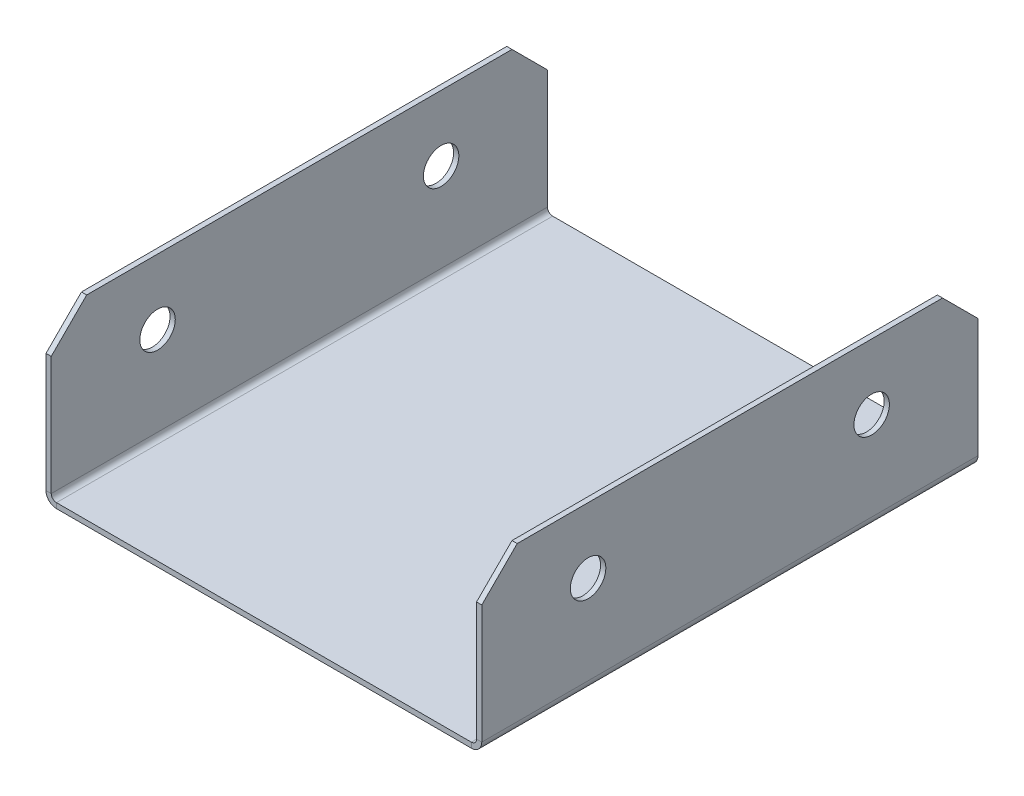
ISO-10303-21;
HEADER;
FILE_DESCRIPTION(('STEP AP214'),'2;1');
FILE_NAME('part.step','',(''),(''),'','','');
FILE_SCHEMA(('AUTOMOTIVE_DESIGN { 1 0 10303 214 1 1 1 1 }'));
ENDSEC;
DATA;
#1=APPLICATION_CONTEXT('core data for automotive mechanical design processes');
#2=APPLICATION_PROTOCOL_DEFINITION('international standard','automotive_design',2000,#1);
#3=PRODUCT_CONTEXT('',#1,'mechanical');
#4=PRODUCT('Part','Part','',(#3));
#5=PRODUCT_RELATED_PRODUCT_CATEGORY('part','',(#4));
#6=PRODUCT_DEFINITION_FORMATION('','',#4);
#7=PRODUCT_DEFINITION_CONTEXT('part definition',#1,'design');
#8=PRODUCT_DEFINITION('design','',#6,#7);
#9=PRODUCT_DEFINITION_SHAPE('','',#8);
#10=(LENGTH_UNIT() NAMED_UNIT(*) SI_UNIT(.MILLI.,.METRE.));
#11=(NAMED_UNIT(*) PLANE_ANGLE_UNIT() SI_UNIT($,.RADIAN.));
#12=(NAMED_UNIT(*) SI_UNIT($,.STERADIAN.) SOLID_ANGLE_UNIT());
#13=UNCERTAINTY_MEASURE_WITH_UNIT(LENGTH_MEASURE(1.E-05),#10,'distance_accuracy_value','');
#14=(GEOMETRIC_REPRESENTATION_CONTEXT(3) GLOBAL_UNCERTAINTY_ASSIGNED_CONTEXT((#13)) GLOBAL_UNIT_ASSIGNED_CONTEXT((#10,
#11,#12)) REPRESENTATION_CONTEXT('',''));
#15=CARTESIAN_POINT('',(0.,0.,0.));
#16=DIRECTION('',(0.,0.,1.));
#17=DIRECTION('',(1.,0.,0.));
#18=AXIS2_PLACEMENT_3D('',#15,#16,#17);
#19=CARTESIAN_POINT('',(-29.2634,0.,70.));
#20=DIRECTION('',(0.,0.,1.));
#21=DIRECTION('',(1.,0.,0.));
#22=AXIS2_PLACEMENT_3D('',#19,#20,#21);
#23=PLANE('',#22);
#24=DIRECTION('',(0.,-1.,0.));
#25=VECTOR('',#24,1.);
#26=CARTESIAN_POINT('',(-29.2634,0.,70.));
#27=LINE('',#26,#25);
#28=CARTESIAN_POINT('',(-29.2634,0.,70.));
#29=VERTEX_POINT('',#28);
#30=CARTESIAN_POINT('',(-29.2634,-0.7366,70.));
#31=VERTEX_POINT('',#30);
#32=EDGE_CURVE('E270',#29,#31,#27,.T.);
#33=ORIENTED_EDGE('',*,*,#32,.F.);
#34=CARTESIAN_POINT('',(-29.2634,0.736600000000004,70.));
#35=DIRECTION('',(0.,0.,-1.));
#36=DIRECTION('',(-1.,0.,0.));
#37=AXIS2_PLACEMENT_3D('',#34,#35,#36);
#38=CIRCLE('',#37,0.7366);
#39=CARTESIAN_POINT('',(-30.,0.736600000000018,70.));
#40=VERTEX_POINT('',#39);
#41=EDGE_CURVE('E186',#40,#29,#38,.F.);
#42=ORIENTED_EDGE('',*,*,#41,.F.);
#43=DIRECTION('',(1.,0.,0.));
#44=VECTOR('',#43,1.);
#45=CARTESIAN_POINT('',(-30.7366,0.736600000000032,70.));
#46=LINE('',#45,#44);
#47=CARTESIAN_POINT('',(-30.7366,0.736600000000032,70.));
#48=VERTEX_POINT('',#47);
#49=EDGE_CURVE('E267',#48,#40,#46,.T.);
#50=ORIENTED_EDGE('',*,*,#49,.F.);
#51=CARTESIAN_POINT('',(-29.2634,0.736600000000004,70.));
#52=DIRECTION('',(0.,0.,1.));
#53=DIRECTION('',(1.,0.,0.));
#54=AXIS2_PLACEMENT_3D('',#51,#52,#53);
#55=CIRCLE('',#54,1.4732);
#56=EDGE_CURVE('E196',#48,#31,#55,.T.);
#57=ORIENTED_EDGE('',*,*,#56,.T.);
#58=EDGE_LOOP('',(#33,#42,#50,#57));
#59=FACE_BOUND('',#58,.T.);
#60=ADVANCED_FACE('F37',(#59),#23,.T.);
#61=CARTESIAN_POINT('',(-30.7366,0.736600000000032,70.));
#62=DIRECTION('',(0.,0.,1.));
#63=DIRECTION('',(1.,0.,0.));
#64=AXIS2_PLACEMENT_3D('',#61,#62,#63);
#65=PLANE('',#64);
#66=DIRECTION('',(1.,0.,0.));
#67=VECTOR('',#66,1.);
#68=CARTESIAN_POINT('',(-30.,0.,70.));
#69=LINE('',#68,#67);
#70=CARTESIAN_POINT('',(29.2634,0.,70.));
#71=VERTEX_POINT('',#70);
#72=EDGE_CURVE('E184',#29,#71,#69,.T.);
#73=ORIENTED_EDGE('',*,*,#72,.F.);
#74=ORIENTED_EDGE('',*,*,#32,.T.);
#75=DIRECTION('',(1.,0.,0.));
#76=VECTOR('',#75,1.);
#77=CARTESIAN_POINT('',(-30.,-0.7366,70.));
#78=LINE('',#77,#76);
#79=CARTESIAN_POINT('',(29.2634,-0.736599999999989,70.));
#80=VERTEX_POINT('',#79);
#81=EDGE_CURVE('E199',#31,#80,#78,.T.);
#82=ORIENTED_EDGE('',*,*,#81,.T.);
#83=DIRECTION('',(0.,1.,0.));
#84=VECTOR('',#83,1.);
#85=CARTESIAN_POINT('',(29.2634,-0.736599999999989,70.));
#86=LINE('',#85,#84);
#87=EDGE_CURVE('E164',#80,#71,#86,.T.);
#88=ORIENTED_EDGE('',*,*,#87,.T.);
#89=EDGE_LOOP('',(#73,#74,#82,#88));
#90=FACE_BOUND('',#89,.T.);
#91=ADVANCED_FACE('F358',(#90),#65,.T.);
#92=CARTESIAN_POINT('',(-30.,0.736600000000018,0.));
#93=DIRECTION('',(0.,0.,-1.));
#94=DIRECTION('',(-1.,0.,0.));
#95=AXIS2_PLACEMENT_3D('',#92,#93,#94);
#96=PLANE('',#95);
#97=DIRECTION('',(-1.,0.,0.));
#98=VECTOR('',#97,1.);
#99=CARTESIAN_POINT('',(-30.,0.736600000000018,0.));
#100=LINE('',#99,#98);
#101=CARTESIAN_POINT('',(-30.,0.736600000000018,0.));
#102=VERTEX_POINT('',#101);
#103=CARTESIAN_POINT('',(-30.7366,0.736600000000032,0.));
#104=VERTEX_POINT('',#103);
#105=EDGE_CURVE('E264',#102,#104,#100,.T.);
#106=ORIENTED_EDGE('',*,*,#105,.F.);
#107=CARTESIAN_POINT('',(-29.2634,0.736600000000004,0.));
#108=DIRECTION('',(0.,0.,-1.));
#109=DIRECTION('',(-1.,0.,0.));
#110=AXIS2_PLACEMENT_3D('',#107,#108,#109);
#111=CIRCLE('',#110,0.7366);
#112=CARTESIAN_POINT('',(-29.2634,0.,0.));
#113=VERTEX_POINT('',#112);
#114=EDGE_CURVE('E214',#102,#113,#111,.F.);
#115=ORIENTED_EDGE('',*,*,#114,.T.);
#116=DIRECTION('',(0.,1.,0.));
#117=VECTOR('',#116,1.);
#118=CARTESIAN_POINT('',(-29.2634,-0.7366,0.));
#119=LINE('',#118,#117);
#120=CARTESIAN_POINT('',(-29.2634,-0.7366,0.));
#121=VERTEX_POINT('',#120);
#122=EDGE_CURVE('E163',#121,#113,#119,.T.);
#123=ORIENTED_EDGE('',*,*,#122,.F.);
#124=CARTESIAN_POINT('',(-29.2634,0.736600000000004,0.));
#125=DIRECTION('',(0.,0.,1.));
#126=DIRECTION('',(1.,0.,0.));
#127=AXIS2_PLACEMENT_3D('',#124,#125,#126);
#128=CIRCLE('',#127,1.4732);
#129=EDGE_CURVE('E221',#104,#121,#128,.T.);
#130=ORIENTED_EDGE('',*,*,#129,.F.);
#131=EDGE_LOOP('',(#106,#115,#123,#130));
#132=FACE_BOUND('',#131,.T.);
#133=ADVANCED_FACE('F320',(#132),#96,.T.);
#134=CARTESIAN_POINT('',(-29.2634,-0.7366,0.));
#135=DIRECTION('',(0.,0.,-1.));
#136=DIRECTION('',(-1.,0.,0.));
#137=AXIS2_PLACEMENT_3D('',#134,#135,#136);
#138=PLANE('',#137);
#139=DIRECTION('',(0.,1.,0.));
#140=VECTOR('',#139,1.);
#141=CARTESIAN_POINT('',(-30.7366,22.5,0.));
#142=LINE('',#141,#140);
#143=CARTESIAN_POINT('',(-30.7366,17.5,0.));
#144=VERTEX_POINT('',#143);
#145=EDGE_CURVE('E219',#144,#104,#142,.F.);
#146=ORIENTED_EDGE('',*,*,#145,.F.);
#147=DIRECTION('',(1.,0.,0.));
#148=VECTOR('',#147,1.);
#149=CARTESIAN_POINT('',(-29.2634,17.5,0.));
#150=LINE('',#149,#148);
#151=CARTESIAN_POINT('',(-30.,17.5,0.));
#152=VERTEX_POINT('',#151);
#153=EDGE_CURVE('E45',#144,#152,#150,.T.);
#154=ORIENTED_EDGE('',*,*,#153,.T.);
#155=DIRECTION('',(0.,-1.,0.));
#156=VECTOR('',#155,1.);
#157=CARTESIAN_POINT('',(-30.,22.5,0.));
#158=LINE('',#157,#156);
#159=EDGE_CURVE('E217',#152,#102,#158,.T.);
#160=ORIENTED_EDGE('',*,*,#159,.T.);
#161=ORIENTED_EDGE('',*,*,#105,.T.);
#162=EDGE_LOOP('',(#146,#154,#160,#161));
#163=FACE_BOUND('',#162,.T.);
#164=ADVANCED_FACE('F304',(#163),#138,.T.);
#165=CARTESIAN_POINT('',(30.,0.73660000000001,70.));
#166=DIRECTION('',(0.,0.,1.));
#167=DIRECTION('',(1.,0.,0.));
#168=AXIS2_PLACEMENT_3D('',#165,#166,#167);
#169=PLANE('',#168);
#170=DIRECTION('',(1.,0.,0.));
#171=VECTOR('',#170,1.);
#172=CARTESIAN_POINT('',(30.,0.73660000000001,70.));
#173=LINE('',#172,#171);
#174=CARTESIAN_POINT('',(30.,0.73660000000001,70.));
#175=VERTEX_POINT('',#174);
#176=CARTESIAN_POINT('',(30.7366,0.73660000000001,70.));
#177=VERTEX_POINT('',#176);
#178=EDGE_CURVE('E154',#175,#177,#173,.T.);
#179=ORIENTED_EDGE('',*,*,#178,.F.);
#180=CARTESIAN_POINT('',(29.2634,0.736600000000011,70.));
#181=DIRECTION('',(0.,0.,-1.));
#182=DIRECTION('',(-1.,0.,0.));
#183=AXIS2_PLACEMENT_3D('',#180,#181,#182);
#184=CIRCLE('',#183,0.7366);
#185=EDGE_CURVE('E158',#71,#175,#184,.F.);
#186=ORIENTED_EDGE('',*,*,#185,.F.);
#187=ORIENTED_EDGE('',*,*,#87,.F.);
#188=CARTESIAN_POINT('',(29.2634,0.736600000000011,70.));
#189=DIRECTION('',(0.,0.,1.));
#190=DIRECTION('',(1.,0.,0.));
#191=AXIS2_PLACEMENT_3D('',#188,#189,#190);
#192=CIRCLE('',#191,1.4732);
#193=EDGE_CURVE('E161',#80,#177,#192,.T.);
#194=ORIENTED_EDGE('',*,*,#193,.T.);
#195=EDGE_LOOP('',(#179,#186,#187,#194));
#196=FACE_BOUND('',#195,.T.);
#197=ADVANCED_FACE('F156',(#196),#169,.T.);
#198=CARTESIAN_POINT('',(29.2634,-0.736599999999989,70.));
#199=DIRECTION('',(0.,0.,1.));
#200=DIRECTION('',(1.,0.,0.));
#201=AXIS2_PLACEMENT_3D('',#198,#199,#200);
#202=PLANE('',#201);
#203=DIRECTION('',(0.,1.,0.));
#204=VECTOR('',#203,1.);
#205=CARTESIAN_POINT('',(30.7366,0.,70.));
#206=LINE('',#205,#204);
#207=CARTESIAN_POINT('',(30.7366,17.5,70.));
#208=VERTEX_POINT('',#207);
#209=EDGE_CURVE('E179',#177,#208,#206,.T.);
#210=ORIENTED_EDGE('',*,*,#209,.T.);
#211=DIRECTION('',(-1.,0.,0.));
#212=VECTOR('',#211,1.);
#213=CARTESIAN_POINT('',(29.2634,17.5,70.));
#214=LINE('',#213,#212);
#215=CARTESIAN_POINT('',(30.,17.5,70.));
#216=VERTEX_POINT('',#215);
#217=EDGE_CURVE('E60',#208,#216,#214,.T.);
#218=ORIENTED_EDGE('',*,*,#217,.T.);
#219=DIRECTION('',(0.,1.,0.));
#220=VECTOR('',#219,1.);
#221=CARTESIAN_POINT('',(30.,0.,70.));
#222=LINE('',#221,#220);
#223=EDGE_CURVE('E169',#175,#216,#222,.T.);
#224=ORIENTED_EDGE('',*,*,#223,.F.);
#225=ORIENTED_EDGE('',*,*,#178,.T.);
#226=EDGE_LOOP('',(#210,#218,#224,#225));
#227=FACE_BOUND('',#226,.T.);
#228=ADVANCED_FACE('F178',(#227),#202,.T.);
#229=CARTESIAN_POINT('',(29.2634,0.,0.));
#230=DIRECTION('',(0.,0.,-1.));
#231=DIRECTION('',(-1.,0.,0.));
#232=AXIS2_PLACEMENT_3D('',#229,#230,#231);
#233=PLANE('',#232);
#234=DIRECTION('',(0.,-1.,0.));
#235=VECTOR('',#234,1.);
#236=CARTESIAN_POINT('',(29.2634,0.,0.));
#237=LINE('',#236,#235);
#238=CARTESIAN_POINT('',(29.2634,0.,0.));
#239=VERTEX_POINT('',#238);
#240=CARTESIAN_POINT('',(29.2634,-0.736599999999989,0.));
#241=VERTEX_POINT('',#240);
#242=EDGE_CURVE('E260',#239,#241,#237,.T.);
#243=ORIENTED_EDGE('',*,*,#242,.F.);
#244=CARTESIAN_POINT('',(29.2634,0.736600000000011,0.));
#245=DIRECTION('',(0.,0.,-1.));
#246=DIRECTION('',(-1.,0.,0.));
#247=AXIS2_PLACEMENT_3D('',#244,#245,#246);
#248=CIRCLE('',#247,0.7366);
#249=CARTESIAN_POINT('',(30.,0.73660000000001,0.));
#250=VERTEX_POINT('',#249);
#251=EDGE_CURVE('E209',#239,#250,#248,.F.);
#252=ORIENTED_EDGE('',*,*,#251,.T.);
#253=DIRECTION('',(-1.,0.,0.));
#254=VECTOR('',#253,1.);
#255=CARTESIAN_POINT('',(30.7366,0.73660000000001,0.));
#256=LINE('',#255,#254);
#257=CARTESIAN_POINT('',(30.7366,0.73660000000001,0.));
#258=VERTEX_POINT('',#257);
#259=EDGE_CURVE('E258',#258,#250,#256,.T.);
#260=ORIENTED_EDGE('',*,*,#259,.F.);
#261=CARTESIAN_POINT('',(29.2634,0.736600000000011,0.));
#262=DIRECTION('',(0.,0.,1.));
#263=DIRECTION('',(1.,0.,0.));
#264=AXIS2_PLACEMENT_3D('',#261,#262,#263);
#265=CIRCLE('',#264,1.4732);
#266=EDGE_CURVE('E227',#241,#258,#265,.T.);
#267=ORIENTED_EDGE('',*,*,#266,.F.);
#268=EDGE_LOOP('',(#243,#252,#260,#267));
#269=FACE_BOUND('',#268,.T.);
#270=ADVANCED_FACE('F374',(#269),#233,.T.);
#271=CARTESIAN_POINT('',(30.7366,0.73660000000001,0.));
#272=DIRECTION('',(0.,0.,-1.));
#273=DIRECTION('',(-1.,0.,0.));
#274=AXIS2_PLACEMENT_3D('',#271,#272,#273);
#275=PLANE('',#274);
#276=DIRECTION('',(1.,0.,0.));
#277=VECTOR('',#276,1.);
#278=CARTESIAN_POINT('',(-30.,0.,0.));
#279=LINE('',#278,#277);
#280=EDGE_CURVE('E211',#113,#239,#279,.T.);
#281=ORIENTED_EDGE('',*,*,#280,.T.);
#282=ORIENTED_EDGE('',*,*,#242,.T.);
#283=DIRECTION('',(1.,0.,0.));
#284=VECTOR('',#283,1.);
#285=CARTESIAN_POINT('',(-30.,-0.7366,0.));
#286=LINE('',#285,#284);
#287=EDGE_CURVE('E224',#121,#241,#286,.T.);
#288=ORIENTED_EDGE('',*,*,#287,.F.);
#289=ORIENTED_EDGE('',*,*,#122,.T.);
#290=EDGE_LOOP('',(#281,#282,#288,#289));
#291=FACE_BOUND('',#290,.T.);
#292=ADVANCED_FACE('F377',(#291),#275,.T.);
#293=CARTESIAN_POINT('',(30.7366,0.,70.));
#294=DIRECTION('',(-1.,0.,0.));
#295=DIRECTION('',(0.,0.,1.));
#296=AXIS2_PLACEMENT_3D('',#293,#294,#295);
#297=PLANE('',#296);
#298=CARTESIAN_POINT('',(30.7366,13.2634,55.));
#299=DIRECTION('',(1.,0.,0.));
#300=DIRECTION('',(0.,0.,-1.));
#301=AXIS2_PLACEMENT_3D('',#298,#299,#300);
#302=CIRCLE('',#301,2.5);
#303=CARTESIAN_POINT('',(30.7366,13.2634,52.5));
#304=VERTEX_POINT('',#303);
#305=EDGE_CURVE('E442',#304,#304,#302,.T.);
#306=ORIENTED_EDGE('',*,*,#305,.F.);
#307=EDGE_LOOP('',(#306));
#308=FACE_BOUND('',#307,.T.);
#309=CARTESIAN_POINT('',(30.7366,13.2634,15.));
#310=DIRECTION('',(1.,0.,0.));
#311=DIRECTION('',(0.,0.,-1.));
#312=AXIS2_PLACEMENT_3D('',#309,#310,#311);
#313=CIRCLE('',#312,2.5);
#314=CARTESIAN_POINT('',(30.7366,13.2634,12.5));
#315=VERTEX_POINT('',#314);
#316=EDGE_CURVE('E451',#315,#315,#313,.T.);
#317=ORIENTED_EDGE('',*,*,#316,.F.);
#318=EDGE_LOOP('',(#317));
#319=FACE_BOUND('',#318,.T.);
#320=DIRECTION('',(0.,0.,-1.));
#321=VECTOR('',#320,1.);
#322=CARTESIAN_POINT('',(30.7366,22.5,70.));
#323=LINE('',#322,#321);
#324=CARTESIAN_POINT('',(30.7366,22.5,65.));
#325=VERTEX_POINT('',#324);
#326=CARTESIAN_POINT('',(30.7366,22.5,5.));
#327=VERTEX_POINT('',#326);
#328=EDGE_CURVE('E255',#325,#327,#323,.T.);
#329=ORIENTED_EDGE('',*,*,#328,.F.);
#330=DIRECTION('',(0.,0.707106781186547,-0.707106781186549));
#331=VECTOR('',#330,1.);
#332=CARTESIAN_POINT('',(30.7366,22.5,65.));
#333=LINE('',#332,#331);
#334=EDGE_CURVE('E294',#325,#208,#333,.F.);
#335=ORIENTED_EDGE('',*,*,#334,.T.);
#336=ORIENTED_EDGE('',*,*,#209,.F.);
#337=DIRECTION('',(0.,0.,-1.));
#338=VECTOR('',#337,1.);
#339=CARTESIAN_POINT('',(30.7366,0.73660000000001,70.));
#340=LINE('',#339,#338);
#341=EDGE_CURVE('E203',#177,#258,#340,.T.);
#342=ORIENTED_EDGE('',*,*,#341,.T.);
#343=DIRECTION('',(0.,1.,0.));
#344=VECTOR('',#343,1.);
#345=CARTESIAN_POINT('',(30.7366,0.,0.));
#346=LINE('',#345,#344);
#347=CARTESIAN_POINT('',(30.7366,17.5,0.));
#348=VERTEX_POINT('',#347);
#349=EDGE_CURVE('E204',#258,#348,#346,.T.);
#350=ORIENTED_EDGE('',*,*,#349,.T.);
#351=DIRECTION('',(0.,-0.707106781186549,-0.707106781186547));
#352=VECTOR('',#351,1.);
#353=CARTESIAN_POINT('',(30.7366,17.5,0.));
#354=LINE('',#353,#352);
#355=EDGE_CURVE('E292',#348,#327,#354,.F.);
#356=ORIENTED_EDGE('',*,*,#355,.T.);
#357=EDGE_LOOP('',(#329,#335,#336,#342,#350,#356));
#358=FACE_BOUND('',#357,.T.);
#359=ADVANCED_FACE('F381',(#308,#319,#358),#297,.F.);
#360=CARTESIAN_POINT('',(30.,22.5,70.));
#361=DIRECTION('',(0.,1.,0.));
#362=DIRECTION('',(0.,0.,1.));
#363=AXIS2_PLACEMENT_3D('',#360,#361,#362);
#364=PLANE('',#363);
#365=DIRECTION('',(0.,0.,-1.));
#366=VECTOR('',#365,1.);
#367=CARTESIAN_POINT('',(30.,22.5,70.));
#368=LINE('',#367,#366);
#369=CARTESIAN_POINT('',(30.,22.5,65.));
#370=VERTEX_POINT('',#369);
#371=CARTESIAN_POINT('',(30.,22.5,5.));
#372=VERTEX_POINT('',#371);
#373=EDGE_CURVE('E175',#370,#372,#368,.T.);
#374=ORIENTED_EDGE('',*,*,#373,.F.);
#375=DIRECTION('',(1.,0.,0.));
#376=VECTOR('',#375,1.);
#377=CARTESIAN_POINT('',(30.,22.5,65.));
#378=LINE('',#377,#376);
#379=EDGE_CURVE('E289',#370,#325,#378,.T.);
#380=ORIENTED_EDGE('',*,*,#379,.T.);
#381=ORIENTED_EDGE('',*,*,#328,.T.);
#382=DIRECTION('',(-1.,0.,0.));
#383=VECTOR('',#382,1.);
#384=CARTESIAN_POINT('',(30.,22.5,5.));
#385=LINE('',#384,#383);
#386=EDGE_CURVE('E287',#327,#372,#385,.T.);
#387=ORIENTED_EDGE('',*,*,#386,.T.);
#388=EDGE_LOOP('',(#374,#380,#381,#387));
#389=FACE_BOUND('',#388,.T.);
#390=ADVANCED_FACE('F385',(#389),#364,.T.);
#391=CARTESIAN_POINT('',(30.,0.,70.));
#392=DIRECTION('',(-1.,0.,0.));
#393=DIRECTION('',(0.,0.,1.));
#394=AXIS2_PLACEMENT_3D('',#391,#392,#393);
#395=PLANE('',#394);
#396=CARTESIAN_POINT('',(30.,13.2634,55.));
#397=DIRECTION('',(-1.,0.,0.));
#398=DIRECTION('',(0.,0.,1.));
#399=AXIS2_PLACEMENT_3D('',#396,#397,#398);
#400=CIRCLE('',#399,2.5);
#401=CARTESIAN_POINT('',(30.,13.2634,57.5));
#402=VERTEX_POINT('',#401);
#403=EDGE_CURVE('E444',#402,#402,#400,.T.);
#404=ORIENTED_EDGE('',*,*,#403,.F.);
#405=EDGE_LOOP('',(#404));
#406=FACE_BOUND('',#405,.T.);
#407=CARTESIAN_POINT('',(30.,13.2634,15.));
#408=DIRECTION('',(-1.,0.,0.));
#409=DIRECTION('',(0.,0.,1.));
#410=AXIS2_PLACEMENT_3D('',#407,#408,#409);
#411=CIRCLE('',#410,2.5);
#412=CARTESIAN_POINT('',(30.,13.2634,17.5));
#413=VERTEX_POINT('',#412);
#414=EDGE_CURVE('E207',#413,#413,#411,.T.);
#415=ORIENTED_EDGE('',*,*,#414,.F.);
#416=EDGE_LOOP('',(#415));
#417=FACE_BOUND('',#416,.T.);
#418=ORIENTED_EDGE('',*,*,#223,.T.);
#419=DIRECTION('',(0.,-0.707106781186547,0.707106781186549));
#420=VECTOR('',#419,1.);
#421=CARTESIAN_POINT('',(30.,8.75000000000003,78.75));
#422=LINE('',#421,#420);
#423=EDGE_CURVE('E298',#216,#370,#422,.F.);
#424=ORIENTED_EDGE('',*,*,#423,.T.);
#425=ORIENTED_EDGE('',*,*,#373,.T.);
#426=DIRECTION('',(0.,0.707106781186549,0.707106781186547));
#427=VECTOR('',#426,1.);
#428=CARTESIAN_POINT('',(30.,43.75,26.2499999999999));
#429=LINE('',#428,#427);
#430=CARTESIAN_POINT('',(30.,17.5,0.));
#431=VERTEX_POINT('',#430);
#432=EDGE_CURVE('E52',#372,#431,#429,.F.);
#433=ORIENTED_EDGE('',*,*,#432,.T.);
#434=DIRECTION('',(0.,1.,0.));
#435=VECTOR('',#434,1.);
#436=CARTESIAN_POINT('',(30.,0.,0.));
#437=LINE('',#436,#435);
#438=EDGE_CURVE('E171',#250,#431,#437,.T.);
#439=ORIENTED_EDGE('',*,*,#438,.F.);
#440=DIRECTION('',(0.,0.,-1.));
#441=VECTOR('',#440,1.);
#442=CARTESIAN_POINT('',(30.,0.73660000000001,70.));
#443=LINE('',#442,#441);
#444=EDGE_CURVE('E167',#175,#250,#443,.T.);
#445=ORIENTED_EDGE('',*,*,#444,.F.);
#446=EDGE_LOOP('',(#418,#424,#425,#433,#439,#445));
#447=FACE_BOUND('',#446,.T.);
#448=ADVANCED_FACE('F168',(#406,#417,#447),#395,.T.);
#449=CARTESIAN_POINT('',(29.2634,0.736600000000011,70.));
#450=DIRECTION('',(0.,0.,-1.));
#451=DIRECTION('',(-1.,0.,0.));
#452=AXIS2_PLACEMENT_3D('',#449,#450,#451);
#453=CYLINDRICAL_SURFACE('',#452,0.7366);
#454=ORIENTED_EDGE('',*,*,#251,.F.);
#455=DIRECTION('',(0.,0.,-1.));
#456=VECTOR('',#455,1.);
#457=CARTESIAN_POINT('',(29.2634,0.,70.));
#458=LINE('',#457,#456);
#459=EDGE_CURVE('E176',#71,#239,#458,.T.);
#460=ORIENTED_EDGE('',*,*,#459,.F.);
#461=ORIENTED_EDGE('',*,*,#185,.T.);
#462=ORIENTED_EDGE('',*,*,#444,.T.);
#463=EDGE_LOOP('',(#454,#460,#461,#462));
#464=FACE_BOUND('',#463,.T.);
#465=ADVANCED_FACE('F182',(#464),#453,.F.);
#466=CARTESIAN_POINT('',(-30.,0.,70.));
#467=DIRECTION('',(0.,1.,0.));
#468=DIRECTION('',(-1.,0.,0.));
#469=AXIS2_PLACEMENT_3D('',#466,#467,#468);
#470=PLANE('',#469);
#471=ORIENTED_EDGE('',*,*,#280,.F.);
#472=DIRECTION('',(0.,0.,-1.));
#473=VECTOR('',#472,1.);
#474=CARTESIAN_POINT('',(-29.2634,0.,70.));
#475=LINE('',#474,#473);
#476=EDGE_CURVE('E250',#29,#113,#475,.T.);
#477=ORIENTED_EDGE('',*,*,#476,.F.);
#478=ORIENTED_EDGE('',*,*,#72,.T.);
#479=ORIENTED_EDGE('',*,*,#459,.T.);
#480=EDGE_LOOP('',(#471,#477,#478,#479));
#481=FACE_BOUND('',#480,.T.);
#482=ADVANCED_FACE('F395',(#481),#470,.T.);
#483=CARTESIAN_POINT('',(-29.2634,0.736600000000004,70.));
#484=DIRECTION('',(0.,0.,-1.));
#485=DIRECTION('',(-1.,0.,0.));
#486=AXIS2_PLACEMENT_3D('',#483,#484,#485);
#487=CYLINDRICAL_SURFACE('',#486,0.7366);
#488=ORIENTED_EDGE('',*,*,#114,.F.);
#489=DIRECTION('',(0.,0.,-1.));
#490=VECTOR('',#489,1.);
#491=CARTESIAN_POINT('',(-30.,0.736600000000018,70.));
#492=LINE('',#491,#490);
#493=EDGE_CURVE('E247',#40,#102,#492,.T.);
#494=ORIENTED_EDGE('',*,*,#493,.F.);
#495=ORIENTED_EDGE('',*,*,#41,.T.);
#496=ORIENTED_EDGE('',*,*,#476,.T.);
#497=EDGE_LOOP('',(#488,#494,#495,#496));
#498=FACE_BOUND('',#497,.T.);
#499=ADVANCED_FACE('F316',(#498),#487,.F.);
#500=CARTESIAN_POINT('',(-30.,22.5,70.));
#501=DIRECTION('',(1.,0.,0.));
#502=DIRECTION('',(0.,0.,-1.));
#503=AXIS2_PLACEMENT_3D('',#500,#501,#502);
#504=PLANE('',#503);
#505=CARTESIAN_POINT('',(-30.,13.2634,55.));
#506=DIRECTION('',(1.,0.,0.));
#507=DIRECTION('',(0.,0.,-1.));
#508=AXIS2_PLACEMENT_3D('',#505,#506,#507);
#509=CIRCLE('',#508,2.5);
#510=CARTESIAN_POINT('',(-30.,13.2634,52.5));
#511=VERTEX_POINT('',#510);
#512=EDGE_CURVE('E438',#511,#511,#509,.T.);
#513=ORIENTED_EDGE('',*,*,#512,.F.);
#514=EDGE_LOOP('',(#513));
#515=FACE_BOUND('',#514,.T.);
#516=CARTESIAN_POINT('',(-30.,13.2634,15.));
#517=DIRECTION('',(1.,0.,0.));
#518=DIRECTION('',(0.,0.,-1.));
#519=AXIS2_PLACEMENT_3D('',#516,#517,#518);
#520=CIRCLE('',#519,2.5);
#521=CARTESIAN_POINT('',(-30.,13.2634,12.5));
#522=VERTEX_POINT('',#521);
#523=EDGE_CURVE('E457',#522,#522,#520,.T.);
#524=ORIENTED_EDGE('',*,*,#523,.F.);
#525=EDGE_LOOP('',(#524));
#526=FACE_BOUND('',#525,.T.);
#527=DIRECTION('',(0.,0.,-1.));
#528=VECTOR('',#527,1.);
#529=CARTESIAN_POINT('',(-30.,22.5,70.));
#530=LINE('',#529,#528);
#531=CARTESIAN_POINT('',(-30.,22.5,65.));
#532=VERTEX_POINT('',#531);
#533=CARTESIAN_POINT('',(-30.,22.5,5.));
#534=VERTEX_POINT('',#533);
#535=EDGE_CURVE('E244',#532,#534,#530,.T.);
#536=ORIENTED_EDGE('',*,*,#535,.F.);
#537=DIRECTION('',(0.,-0.707106781186547,0.707106781186549));
#538=VECTOR('',#537,1.);
#539=CARTESIAN_POINT('',(-30.,20.,67.5));
#540=LINE('',#539,#538);
#541=CARTESIAN_POINT('',(-30.,17.5,70.));
#542=VERTEX_POINT('',#541);
#543=EDGE_CURVE('E279',#532,#542,#540,.T.);
#544=ORIENTED_EDGE('',*,*,#543,.T.);
#545=DIRECTION('',(0.,-1.,0.));
#546=VECTOR('',#545,1.);
#547=CARTESIAN_POINT('',(-30.,22.5,70.));
#548=LINE('',#547,#546);
#549=EDGE_CURVE('E192',#542,#40,#548,.T.);
#550=ORIENTED_EDGE('',*,*,#549,.T.);
#551=ORIENTED_EDGE('',*,*,#493,.T.);
#552=ORIENTED_EDGE('',*,*,#159,.F.);
#553=DIRECTION('',(0.,-0.707106781186549,-0.707106781186547));
#554=VECTOR('',#553,1.);
#555=CARTESIAN_POINT('',(-30.,55.,37.4999999999999));
#556=LINE('',#555,#554);
#557=EDGE_CURVE('E277',#152,#534,#556,.F.);
#558=ORIENTED_EDGE('',*,*,#557,.T.);
#559=EDGE_LOOP('',(#536,#544,#550,#551,#552,#558));
#560=FACE_BOUND('',#559,.T.);
#561=ADVANCED_FACE('F310',(#515,#526,#560),#504,.T.);
#562=CARTESIAN_POINT('',(-30.7366,22.5,70.));
#563=DIRECTION('',(0.,1.,0.));
#564=DIRECTION('',(0.,0.,1.));
#565=AXIS2_PLACEMENT_3D('',#562,#563,#564);
#566=PLANE('',#565);
#567=DIRECTION('',(0.,0.,-1.));
#568=VECTOR('',#567,1.);
#569=CARTESIAN_POINT('',(-30.7366,22.5,70.));
#570=LINE('',#569,#568);
#571=CARTESIAN_POINT('',(-30.7366,22.5,65.));
#572=VERTEX_POINT('',#571);
#573=CARTESIAN_POINT('',(-30.7366,22.5,5.));
#574=VERTEX_POINT('',#573);
#575=EDGE_CURVE('E241',#572,#574,#570,.T.);
#576=ORIENTED_EDGE('',*,*,#575,.F.);
#577=DIRECTION('',(1.,0.,0.));
#578=VECTOR('',#577,1.);
#579=CARTESIAN_POINT('',(-30.,22.5,65.));
#580=LINE('',#579,#578);
#581=EDGE_CURVE('E274',#572,#532,#580,.T.);
#582=ORIENTED_EDGE('',*,*,#581,.T.);
#583=ORIENTED_EDGE('',*,*,#535,.T.);
#584=DIRECTION('',(-1.,0.,0.));
#585=VECTOR('',#584,1.);
#586=CARTESIAN_POINT('',(-30.7366,22.5,5.));
#587=LINE('',#586,#585);
#588=EDGE_CURVE('E272',#534,#574,#587,.T.);
#589=ORIENTED_EDGE('',*,*,#588,.T.);
#590=EDGE_LOOP('',(#576,#582,#583,#589));
#591=FACE_BOUND('',#590,.T.);
#592=ADVANCED_FACE('F335',(#591),#566,.T.);
#593=CARTESIAN_POINT('',(-30.7366,22.5,70.));
#594=DIRECTION('',(1.,0.,0.));
#595=DIRECTION('',(0.,0.,-1.));
#596=AXIS2_PLACEMENT_3D('',#593,#594,#595);
#597=PLANE('',#596);
#598=CARTESIAN_POINT('',(-30.7366,13.2634,55.));
#599=DIRECTION('',(1.,0.,0.));
#600=DIRECTION('',(0.,0.,-1.));
#601=AXIS2_PLACEMENT_3D('',#598,#599,#600);
#602=CIRCLE('',#601,2.5);
#603=CARTESIAN_POINT('',(-30.7366,13.2634,52.5));
#604=VERTEX_POINT('',#603);
#605=EDGE_CURVE('E441',#604,#604,#602,.T.);
#606=ORIENTED_EDGE('',*,*,#605,.T.);
#607=EDGE_LOOP('',(#606));
#608=FACE_BOUND('',#607,.T.);
#609=CARTESIAN_POINT('',(-30.7366,13.2634,15.));
#610=DIRECTION('',(1.,0.,0.));
#611=DIRECTION('',(0.,0.,-1.));
#612=AXIS2_PLACEMENT_3D('',#609,#610,#611);
#613=CIRCLE('',#612,2.5);
#614=CARTESIAN_POINT('',(-30.7366,13.2634,12.5));
#615=VERTEX_POINT('',#614);
#616=EDGE_CURVE('E454',#615,#615,#613,.T.);
#617=ORIENTED_EDGE('',*,*,#616,.T.);
#618=EDGE_LOOP('',(#617));
#619=FACE_BOUND('',#618,.T.);
#620=DIRECTION('',(0.,1.,0.));
#621=VECTOR('',#620,1.);
#622=CARTESIAN_POINT('',(-30.7366,22.5,70.));
#623=LINE('',#622,#621);
#624=CARTESIAN_POINT('',(-30.7366,17.5,70.));
#625=VERTEX_POINT('',#624);
#626=EDGE_CURVE('E194',#625,#48,#623,.F.);
#627=ORIENTED_EDGE('',*,*,#626,.F.);
#628=DIRECTION('',(0.,0.707106781186547,-0.707106781186549));
#629=VECTOR('',#628,1.);
#630=CARTESIAN_POINT('',(-30.7366,22.5,65.));
#631=LINE('',#630,#629);
#632=EDGE_CURVE('E285',#625,#572,#631,.T.);
#633=ORIENTED_EDGE('',*,*,#632,.T.);
#634=ORIENTED_EDGE('',*,*,#575,.T.);
#635=DIRECTION('',(0.,0.707106781186549,0.707106781186547));
#636=VECTOR('',#635,1.);
#637=CARTESIAN_POINT('',(-30.7366,17.5,0.));
#638=LINE('',#637,#636);
#639=EDGE_CURVE('E283',#574,#144,#638,.F.);
#640=ORIENTED_EDGE('',*,*,#639,.T.);
#641=ORIENTED_EDGE('',*,*,#145,.T.);
#642=DIRECTION('',(0.,0.,-1.));
#643=VECTOR('',#642,1.);
#644=CARTESIAN_POINT('',(-30.7366,0.736600000000032,70.));
#645=LINE('',#644,#643);
#646=EDGE_CURVE('E238',#48,#104,#645,.T.);
#647=ORIENTED_EDGE('',*,*,#646,.F.);
#648=EDGE_LOOP('',(#627,#633,#634,#640,#641,#647));
#649=FACE_BOUND('',#648,.T.);
#650=ADVANCED_FACE('F329',(#608,#619,#649),#597,.F.);
#651=CARTESIAN_POINT('',(-29.2634,0.736600000000004,70.));
#652=DIRECTION('',(0.,0.,-1.));
#653=DIRECTION('',(-1.,0.,0.));
#654=AXIS2_PLACEMENT_3D('',#651,#652,#653);
#655=CYLINDRICAL_SURFACE('',#654,1.4732);
#656=ORIENTED_EDGE('',*,*,#129,.T.);
#657=DIRECTION('',(0.,0.,-1.));
#658=VECTOR('',#657,1.);
#659=CARTESIAN_POINT('',(-29.2634,-0.7366,70.));
#660=LINE('',#659,#658);
#661=EDGE_CURVE('E235',#31,#121,#660,.T.);
#662=ORIENTED_EDGE('',*,*,#661,.F.);
#663=ORIENTED_EDGE('',*,*,#56,.F.);
#664=ORIENTED_EDGE('',*,*,#646,.T.);
#665=EDGE_LOOP('',(#656,#662,#663,#664));
#666=FACE_BOUND('',#665,.T.);
#667=ADVANCED_FACE('F325',(#666),#655,.T.);
#668=CARTESIAN_POINT('',(-30.,-0.7366,70.));
#669=DIRECTION('',(0.,1.,0.));
#670=DIRECTION('',(-1.,0.,0.));
#671=AXIS2_PLACEMENT_3D('',#668,#669,#670);
#672=PLANE('',#671);
#673=ORIENTED_EDGE('',*,*,#287,.T.);
#674=DIRECTION('',(0.,0.,-1.));
#675=VECTOR('',#674,1.);
#676=CARTESIAN_POINT('',(29.2634,-0.736599999999989,70.));
#677=LINE('',#676,#675);
#678=EDGE_CURVE('E232',#80,#241,#677,.T.);
#679=ORIENTED_EDGE('',*,*,#678,.F.);
#680=ORIENTED_EDGE('',*,*,#81,.F.);
#681=ORIENTED_EDGE('',*,*,#661,.T.);
#682=EDGE_LOOP('',(#673,#679,#680,#681));
#683=FACE_BOUND('',#682,.T.);
#684=ADVANCED_FACE('F411',(#683),#672,.F.);
#685=CARTESIAN_POINT('',(29.2634,0.736600000000011,70.));
#686=DIRECTION('',(0.,0.,-1.));
#687=DIRECTION('',(-1.,0.,0.));
#688=AXIS2_PLACEMENT_3D('',#685,#686,#687);
#689=CYLINDRICAL_SURFACE('',#688,1.4732);
#690=ORIENTED_EDGE('',*,*,#266,.T.);
#691=ORIENTED_EDGE('',*,*,#341,.F.);
#692=ORIENTED_EDGE('',*,*,#193,.F.);
#693=ORIENTED_EDGE('',*,*,#678,.T.);
#694=EDGE_LOOP('',(#690,#691,#692,#693));
#695=FACE_BOUND('',#694,.T.);
#696=ADVANCED_FACE('F414',(#695),#689,.T.);
#697=CARTESIAN_POINT('',(29.2634,0.736600000000011,70.));
#698=DIRECTION('',(0.,0.,-1.));
#699=DIRECTION('',(-1.,0.,0.));
#700=AXIS2_PLACEMENT_3D('',#697,#698,#699);
#701=PLANE('',#700);
#702=ORIENTED_EDGE('',*,*,#549,.F.);
#703=DIRECTION('',(-1.,0.,0.));
#704=VECTOR('',#703,1.);
#705=CARTESIAN_POINT('',(-30.7366,17.5,70.));
#706=LINE('',#705,#704);
#707=EDGE_CURVE('E281',#542,#625,#706,.T.);
#708=ORIENTED_EDGE('',*,*,#707,.T.);
#709=ORIENTED_EDGE('',*,*,#626,.T.);
#710=ORIENTED_EDGE('',*,*,#49,.T.);
#711=EDGE_LOOP('',(#702,#708,#709,#710));
#712=FACE_BOUND('',#711,.T.);
#713=ADVANCED_FACE('F340',(#712),#701,.F.);
#714=CARTESIAN_POINT('',(29.2634,0.736600000000011,0.));
#715=DIRECTION('',(0.,0.,-1.));
#716=DIRECTION('',(-1.,0.,0.));
#717=AXIS2_PLACEMENT_3D('',#714,#715,#716);
#718=PLANE('',#717);
#719=ORIENTED_EDGE('',*,*,#438,.T.);
#720=DIRECTION('',(1.,0.,0.));
#721=VECTOR('',#720,1.);
#722=CARTESIAN_POINT('',(29.2634,17.5,0.));
#723=LINE('',#722,#721);
#724=EDGE_CURVE('E11',#431,#348,#723,.T.);
#725=ORIENTED_EDGE('',*,*,#724,.T.);
#726=ORIENTED_EDGE('',*,*,#349,.F.);
#727=ORIENTED_EDGE('',*,*,#259,.T.);
#728=EDGE_LOOP('',(#719,#725,#726,#727));
#729=FACE_BOUND('',#728,.T.);
#730=ADVANCED_FACE('F419',(#729),#718,.T.);
#731=CARTESIAN_POINT('',(-30.7366,13.2634,15.));
#732=DIRECTION('',(1.,0.,0.));
#733=DIRECTION('',(0.,0.,-1.));
#734=AXIS2_PLACEMENT_3D('',#731,#732,#733);
#735=CYLINDRICAL_SURFACE('',#734,2.5);
#736=ORIENTED_EDGE('',*,*,#523,.T.);
#737=EDGE_LOOP('',(#736));
#738=FACE_BOUND('',#737,.T.);
#739=ORIENTED_EDGE('',*,*,#616,.F.);
#740=EDGE_LOOP('',(#739));
#741=FACE_BOUND('',#740,.T.);
#742=ADVANCED_FACE('F422',(#738,#741),#735,.F.);
#743=ORIENTED_EDGE('',*,*,#414,.T.);
#744=EDGE_LOOP('',(#743));
#745=FACE_BOUND('',#744,.T.);
#746=ORIENTED_EDGE('',*,*,#316,.T.);
#747=EDGE_LOOP('',(#746));
#748=FACE_BOUND('',#747,.T.);
#749=ADVANCED_FACE('F427',(#745,#748),#735,.F.);
#750=CARTESIAN_POINT('',(-30.7366,13.2634,55.));
#751=DIRECTION('',(1.,0.,0.));
#752=DIRECTION('',(0.,0.,-1.));
#753=AXIS2_PLACEMENT_3D('',#750,#751,#752);
#754=CYLINDRICAL_SURFACE('',#753,2.5);
#755=ORIENTED_EDGE('',*,*,#512,.T.);
#756=EDGE_LOOP('',(#755));
#757=FACE_BOUND('',#756,.T.);
#758=ORIENTED_EDGE('',*,*,#605,.F.);
#759=EDGE_LOOP('',(#758));
#760=FACE_BOUND('',#759,.T.);
#761=ADVANCED_FACE('F353',(#757,#760),#754,.F.);
#762=ORIENTED_EDGE('',*,*,#403,.T.);
#763=EDGE_LOOP('',(#762));
#764=FACE_BOUND('',#763,.T.);
#765=ORIENTED_EDGE('',*,*,#305,.T.);
#766=EDGE_LOOP('',(#765));
#767=FACE_BOUND('',#766,.T.);
#768=ADVANCED_FACE('F345',(#764,#767),#754,.F.);
#769=CARTESIAN_POINT('',(-30.7366,22.5,65.));
#770=DIRECTION('',(0.,0.707106781186549,0.707106781186547));
#771=DIRECTION('',(-1.,0.,0.));
#772=AXIS2_PLACEMENT_3D('',#769,#770,#771);
#773=PLANE('',#772);
#774=ORIENTED_EDGE('',*,*,#632,.F.);
#775=ORIENTED_EDGE('',*,*,#707,.F.);
#776=ORIENTED_EDGE('',*,*,#543,.F.);
#777=ORIENTED_EDGE('',*,*,#581,.F.);
#778=EDGE_LOOP('',(#774,#775,#776,#777));
#779=FACE_BOUND('',#778,.T.);
#780=ADVANCED_FACE('F342',(#779),#773,.T.);
#781=CARTESIAN_POINT('',(30.,22.5,65.));
#782=DIRECTION('',(0.,-0.707106781186549,-0.707106781186547));
#783=DIRECTION('',(1.,0.,0.));
#784=AXIS2_PLACEMENT_3D('',#781,#782,#783);
#785=PLANE('',#784);
#786=ORIENTED_EDGE('',*,*,#423,.F.);
#787=ORIENTED_EDGE('',*,*,#217,.F.);
#788=ORIENTED_EDGE('',*,*,#334,.F.);
#789=ORIENTED_EDGE('',*,*,#379,.F.);
#790=EDGE_LOOP('',(#786,#787,#788,#789));
#791=FACE_BOUND('',#790,.T.);
#792=ADVANCED_FACE('F344',(#791),#785,.F.);
#793=CARTESIAN_POINT('',(-29.2634,17.5,0.));
#794=DIRECTION('',(0.,-0.707106781186547,0.707106781186549));
#795=DIRECTION('',(1.,0.,0.));
#796=AXIS2_PLACEMENT_3D('',#793,#794,#795);
#797=PLANE('',#796);
#798=ORIENTED_EDGE('',*,*,#639,.F.);
#799=ORIENTED_EDGE('',*,*,#588,.F.);
#800=ORIENTED_EDGE('',*,*,#557,.F.);
#801=ORIENTED_EDGE('',*,*,#153,.F.);
#802=EDGE_LOOP('',(#798,#799,#800,#801));
#803=FACE_BOUND('',#802,.T.);
#804=ADVANCED_FACE('F333',(#803),#797,.F.);
#805=CARTESIAN_POINT('',(29.2634,17.5,0.));
#806=DIRECTION('',(0.,-0.707106781186547,0.707106781186549));
#807=DIRECTION('',(1.,0.,0.));
#808=AXIS2_PLACEMENT_3D('',#805,#806,#807);
#809=PLANE('',#808);
#810=ORIENTED_EDGE('',*,*,#432,.F.);
#811=ORIENTED_EDGE('',*,*,#386,.F.);
#812=ORIENTED_EDGE('',*,*,#355,.F.);
#813=ORIENTED_EDGE('',*,*,#724,.F.);
#814=EDGE_LOOP('',(#810,#811,#812,#813));
#815=FACE_BOUND('',#814,.T.);
#816=ADVANCED_FACE('F39',(#815),#809,.F.);
#817=CLOSED_SHELL('',(#60,#91,#133,#164,#197,#228,#270,#292,#359,#390,#448,#465,#482,#499,#561,
#592,#650,#667,#684,#696,#713,#730,#742,#749,#761,#768,#780,#792,#804,#816));
#818=MANIFOLD_SOLID_BREP('B2',#817);
#819=ADVANCED_BREP_SHAPE_REPRESENTATION('',(#18,#818),#14);
#820=SHAPE_DEFINITION_REPRESENTATION(#9,#819);
ENDSEC;
END-ISO-10303-21;
